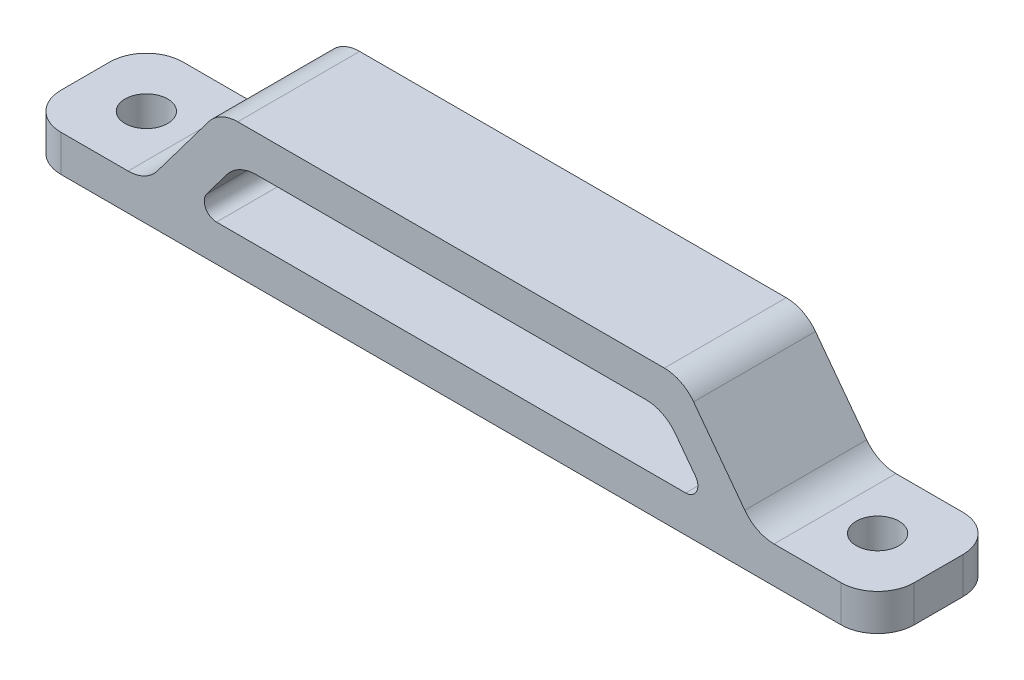
ISO-10303-21;
HEADER;
FILE_DESCRIPTION(('STEP AP214'),'2;1');
FILE_NAME('part.step','',(''),(''),'','','');
FILE_SCHEMA(('AUTOMOTIVE_DESIGN { 1 0 10303 214 1 1 1 1 }'));
ENDSEC;
DATA;
#1=APPLICATION_CONTEXT('core data for automotive mechanical design processes');
#2=APPLICATION_PROTOCOL_DEFINITION('international standard','automotive_design',2000,#1);
#3=PRODUCT_CONTEXT('',#1,'mechanical');
#4=PRODUCT('Part','Part','',(#3));
#5=PRODUCT_RELATED_PRODUCT_CATEGORY('part','',(#4));
#6=PRODUCT_DEFINITION_FORMATION('','',#4);
#7=PRODUCT_DEFINITION_CONTEXT('part definition',#1,'design');
#8=PRODUCT_DEFINITION('design','',#6,#7);
#9=PRODUCT_DEFINITION_SHAPE('','',#8);
#10=(LENGTH_UNIT() NAMED_UNIT(*) SI_UNIT(.MILLI.,.METRE.));
#11=(NAMED_UNIT(*) PLANE_ANGLE_UNIT() SI_UNIT($,.RADIAN.));
#12=(NAMED_UNIT(*) SI_UNIT($,.STERADIAN.) SOLID_ANGLE_UNIT());
#13=UNCERTAINTY_MEASURE_WITH_UNIT(LENGTH_MEASURE(1.E-05),#10,'distance_accuracy_value','');
#14=(GEOMETRIC_REPRESENTATION_CONTEXT(3) GLOBAL_UNCERTAINTY_ASSIGNED_CONTEXT((#13)) GLOBAL_UNIT_ASSIGNED_CONTEXT((#10,
#11,#12)) REPRESENTATION_CONTEXT('',''));
#15=CARTESIAN_POINT('',(0.,0.,0.));
#16=DIRECTION('',(0.,0.,1.));
#17=DIRECTION('',(1.,0.,0.));
#18=AXIS2_PLACEMENT_3D('',#15,#16,#17);
#19=CARTESIAN_POINT('',(0.,3.,0.));
#20=DIRECTION('',(0.,-1.,0.));
#21=DIRECTION('',(0.,0.,-1.));
#22=AXIS2_PLACEMENT_3D('',#19,#20,#21);
#23=PLANE('',#22);
#24=CARTESIAN_POINT('',(5.,3.,-5.));
#25=DIRECTION('',(0.,1.,0.));
#26=DIRECTION('',(0.,0.,1.));
#27=AXIS2_PLACEMENT_3D('',#24,#25,#26);
#28=CIRCLE('',#27,1.75);
#29=CARTESIAN_POINT('',(5.,3.,-3.25));
#30=VERTEX_POINT('',#29);
#31=EDGE_CURVE('E332',#30,#30,#28,.T.);
#32=ORIENTED_EDGE('',*,*,#31,.F.);
#33=EDGE_LOOP('',(#32));
#34=FACE_BOUND('',#33,.T.);
#35=DIRECTION('',(1.,0.,0.));
#36=VECTOR('',#35,1.);
#37=CARTESIAN_POINT('',(0.,3.,0.));
#38=LINE('',#37,#36);
#39=CARTESIAN_POINT('',(3.,3.,0.));
#40=VERTEX_POINT('',#39);
#41=CARTESIAN_POINT('',(8.5,3.,0.));
#42=VERTEX_POINT('',#41);
#43=EDGE_CURVE('E343',#40,#42,#38,.T.);
#44=ORIENTED_EDGE('',*,*,#43,.T.);
#45=DIRECTION('',(0.,0.,1.));
#46=VECTOR('',#45,1.);
#47=CARTESIAN_POINT('',(8.5,3.,0.));
#48=LINE('',#47,#46);
#49=CARTESIAN_POINT('',(8.5,3.,-10.));
#50=VERTEX_POINT('',#49);
#51=EDGE_CURVE('E386',#42,#50,#48,.F.);
#52=ORIENTED_EDGE('',*,*,#51,.T.);
#53=DIRECTION('',(-1.,0.,0.));
#54=VECTOR('',#53,1.);
#55=CARTESIAN_POINT('',(0.,3.,-10.));
#56=LINE('',#55,#54);
#57=CARTESIAN_POINT('',(3.,3.,-10.));
#58=VERTEX_POINT('',#57);
#59=EDGE_CURVE('E349',#50,#58,#56,.T.);
#60=ORIENTED_EDGE('',*,*,#59,.T.);
#61=CARTESIAN_POINT('',(3.,3.,-7.));
#62=DIRECTION('',(0.,-1.,0.));
#63=DIRECTION('',(0.,0.,-1.));
#64=AXIS2_PLACEMENT_3D('',#61,#62,#63);
#65=CIRCLE('',#64,3.);
#66=CARTESIAN_POINT('',(0.,3.,-7.));
#67=VERTEX_POINT('',#66);
#68=EDGE_CURVE('E384',#58,#67,#65,.F.);
#69=ORIENTED_EDGE('',*,*,#68,.T.);
#70=DIRECTION('',(0.,0.,1.));
#71=VECTOR('',#70,1.);
#72=CARTESIAN_POINT('',(0.,3.,0.));
#73=LINE('',#72,#71);
#74=CARTESIAN_POINT('',(0.,3.,-3.));
#75=VERTEX_POINT('',#74);
#76=EDGE_CURVE('E338',#67,#75,#73,.T.);
#77=ORIENTED_EDGE('',*,*,#76,.T.);
#78=CARTESIAN_POINT('',(3.,3.,-3.));
#79=DIRECTION('',(0.,-1.,0.));
#80=DIRECTION('',(0.,0.,-1.));
#81=AXIS2_PLACEMENT_3D('',#78,#79,#80);
#82=CIRCLE('',#81,3.);
#83=EDGE_CURVE('E382',#75,#40,#82,.F.);
#84=ORIENTED_EDGE('',*,*,#83,.T.);
#85=EDGE_LOOP('',(#44,#52,#60,#69,#77,#84));
#86=FACE_BOUND('',#85,.T.);
#87=ADVANCED_FACE('F63',(#34,#86),#23,.F.);
#88=CARTESIAN_POINT('',(67.,3.,-10.));
#89=VERTEX_POINT('',#88);
#90=CARTESIAN_POINT('',(61.5,3.,-10.));
#91=VERTEX_POINT('',#90);
#92=EDGE_CURVE('E235',#89,#91,#56,.T.);
#93=ORIENTED_EDGE('',*,*,#92,.T.);
#94=DIRECTION('',(0.,0.,1.));
#95=VECTOR('',#94,1.);
#96=CARTESIAN_POINT('',(61.5,3.,0.));
#97=LINE('',#96,#95);
#98=CARTESIAN_POINT('',(61.5,3.,0.));
#99=VERTEX_POINT('',#98);
#100=EDGE_CURVE('E369',#91,#99,#97,.T.);
#101=ORIENTED_EDGE('',*,*,#100,.T.);
#102=CARTESIAN_POINT('',(67.,3.,0.));
#103=VERTEX_POINT('',#102);
#104=EDGE_CURVE('E341',#99,#103,#38,.T.);
#105=ORIENTED_EDGE('',*,*,#104,.T.);
#106=CARTESIAN_POINT('',(67.,3.,-2.99999999999999));
#107=DIRECTION('',(0.,-1.,0.));
#108=DIRECTION('',(0.,0.,-1.));
#109=AXIS2_PLACEMENT_3D('',#106,#107,#108);
#110=CIRCLE('',#109,3.);
#111=CARTESIAN_POINT('',(70.,3.,-2.99999999999999));
#112=VERTEX_POINT('',#111);
#113=EDGE_CURVE('E367',#103,#112,#110,.F.);
#114=ORIENTED_EDGE('',*,*,#113,.T.);
#115=DIRECTION('',(0.,0.,-1.));
#116=VECTOR('',#115,1.);
#117=CARTESIAN_POINT('',(70.,3.,0.));
#118=LINE('',#117,#116);
#119=CARTESIAN_POINT('',(70.,3.,-7.00000000000001));
#120=VERTEX_POINT('',#119);
#121=EDGE_CURVE('E346',#112,#120,#118,.T.);
#122=ORIENTED_EDGE('',*,*,#121,.T.);
#123=CARTESIAN_POINT('',(67.,3.,-7.00000000000001));
#124=DIRECTION('',(0.,-1.,0.));
#125=DIRECTION('',(0.,0.,-1.));
#126=AXIS2_PLACEMENT_3D('',#123,#124,#125);
#127=CIRCLE('',#126,3.);
#128=EDGE_CURVE('E365',#120,#89,#127,.F.);
#129=ORIENTED_EDGE('',*,*,#128,.T.);
#130=EDGE_LOOP('',(#93,#101,#105,#114,#122,#129));
#131=FACE_BOUND('',#130,.T.);
#132=CARTESIAN_POINT('',(65.,3.,-5.00000000000001));
#133=DIRECTION('',(0.,1.,0.));
#134=DIRECTION('',(0.,0.,-1.));
#135=AXIS2_PLACEMENT_3D('',#132,#133,#134);
#136=CIRCLE('',#135,1.75);
#137=CARTESIAN_POINT('',(65.,3.,-6.75));
#138=VERTEX_POINT('',#137);
#139=EDGE_CURVE('E326',#138,#138,#136,.T.);
#140=ORIENTED_EDGE('',*,*,#139,.F.);
#141=EDGE_LOOP('',(#140));
#142=FACE_BOUND('',#141,.T.);
#143=ADVANCED_FACE('F445',(#131,#142),#23,.F.);
#144=CARTESIAN_POINT('',(0.,0.,0.));
#145=DIRECTION('',(0.,-1.,0.));
#146=DIRECTION('',(0.,0.,-1.));
#147=AXIS2_PLACEMENT_3D('',#144,#145,#146);
#148=PLANE('',#147);
#149=CARTESIAN_POINT('',(5.,0.,-5.));
#150=DIRECTION('',(0.,1.,0.));
#151=DIRECTION('',(0.,0.,1.));
#152=AXIS2_PLACEMENT_3D('',#149,#150,#151);
#153=CIRCLE('',#152,1.75);
#154=CARTESIAN_POINT('',(5.,0.,-3.25));
#155=VERTEX_POINT('',#154);
#156=EDGE_CURVE('E329',#155,#155,#153,.T.);
#157=ORIENTED_EDGE('',*,*,#156,.T.);
#158=EDGE_LOOP('',(#157));
#159=FACE_BOUND('',#158,.T.);
#160=DIRECTION('',(0.,0.,-1.));
#161=VECTOR('',#160,1.);
#162=CARTESIAN_POINT('',(70.,0.,0.));
#163=LINE('',#162,#161);
#164=CARTESIAN_POINT('',(70.,0.,-2.99999999999999));
#165=VERTEX_POINT('',#164);
#166=CARTESIAN_POINT('',(70.,0.,-7.00000000000001));
#167=VERTEX_POINT('',#166);
#168=EDGE_CURVE('E357',#165,#167,#163,.T.);
#169=ORIENTED_EDGE('',*,*,#168,.F.);
#170=CARTESIAN_POINT('',(67.,0.,-2.99999999999999));
#171=DIRECTION('',(0.,-1.,0.));
#172=DIRECTION('',(0.,0.,-1.));
#173=AXIS2_PLACEMENT_3D('',#170,#171,#172);
#174=CIRCLE('',#173,3.);
#175=CARTESIAN_POINT('',(67.,0.,0.));
#176=VERTEX_POINT('',#175);
#177=EDGE_CURVE('E399',#165,#176,#174,.T.);
#178=ORIENTED_EDGE('',*,*,#177,.T.);
#179=DIRECTION('',(1.,0.,0.));
#180=VECTOR('',#179,1.);
#181=CARTESIAN_POINT('',(0.,0.,0.));
#182=LINE('',#181,#180);
#183=CARTESIAN_POINT('',(3.,0.,0.));
#184=VERTEX_POINT('',#183);
#185=EDGE_CURVE('E354',#184,#176,#182,.T.);
#186=ORIENTED_EDGE('',*,*,#185,.F.);
#187=CARTESIAN_POINT('',(3.,0.,-3.));
#188=DIRECTION('',(0.,-1.,0.));
#189=DIRECTION('',(0.,0.,-1.));
#190=AXIS2_PLACEMENT_3D('',#187,#188,#189);
#191=CIRCLE('',#190,3.);
#192=CARTESIAN_POINT('',(0.,0.,-3.));
#193=VERTEX_POINT('',#192);
#194=EDGE_CURVE('E393',#184,#193,#191,.T.);
#195=ORIENTED_EDGE('',*,*,#194,.T.);
#196=DIRECTION('',(0.,0.,1.));
#197=VECTOR('',#196,1.);
#198=CARTESIAN_POINT('',(0.,0.,0.));
#199=LINE('',#198,#197);
#200=CARTESIAN_POINT('',(0.,0.,-7.));
#201=VERTEX_POINT('',#200);
#202=EDGE_CURVE('E335',#201,#193,#199,.T.);
#203=ORIENTED_EDGE('',*,*,#202,.F.);
#204=CARTESIAN_POINT('',(3.,0.,-7.));
#205=DIRECTION('',(0.,-1.,0.));
#206=DIRECTION('',(0.,0.,-1.));
#207=AXIS2_PLACEMENT_3D('',#204,#205,#206);
#208=CIRCLE('',#207,3.);
#209=CARTESIAN_POINT('',(3.,0.,-10.));
#210=VERTEX_POINT('',#209);
#211=EDGE_CURVE('E395',#201,#210,#208,.T.);
#212=ORIENTED_EDGE('',*,*,#211,.T.);
#213=DIRECTION('',(-1.,0.,0.));
#214=VECTOR('',#213,1.);
#215=CARTESIAN_POINT('',(0.,0.,-10.));
#216=LINE('',#215,#214);
#217=CARTESIAN_POINT('',(67.,0.,-10.));
#218=VERTEX_POINT('',#217);
#219=EDGE_CURVE('E342',#218,#210,#216,.T.);
#220=ORIENTED_EDGE('',*,*,#219,.F.);
#221=CARTESIAN_POINT('',(67.,0.,-7.00000000000001));
#222=DIRECTION('',(0.,-1.,0.));
#223=DIRECTION('',(0.,0.,-1.));
#224=AXIS2_PLACEMENT_3D('',#221,#222,#223);
#225=CIRCLE('',#224,3.);
#226=EDGE_CURVE('E397',#218,#167,#225,.T.);
#227=ORIENTED_EDGE('',*,*,#226,.T.);
#228=EDGE_LOOP('',(#169,#178,#186,#195,#203,#212,#220,#227));
#229=FACE_BOUND('',#228,.T.);
#230=CARTESIAN_POINT('',(65.,0.,-5.00000000000001));
#231=DIRECTION('',(0.,1.,0.));
#232=DIRECTION('',(0.,0.,-1.));
#233=AXIS2_PLACEMENT_3D('',#230,#231,#232);
#234=CIRCLE('',#233,1.75);
#235=CARTESIAN_POINT('',(65.,0.,-6.75));
#236=VERTEX_POINT('',#235);
#237=EDGE_CURVE('E310',#236,#236,#234,.T.);
#238=ORIENTED_EDGE('',*,*,#237,.T.);
#239=EDGE_LOOP('',(#238));
#240=FACE_BOUND('',#239,.T.);
#241=ADVANCED_FACE('F452',(#159,#229,#240),#148,.T.);
#242=CARTESIAN_POINT('',(0.,3.,0.));
#243=DIRECTION('',(1.,0.,0.));
#244=DIRECTION('',(0.,0.,-1.));
#245=AXIS2_PLACEMENT_3D('',#242,#243,#244);
#246=PLANE('',#245);
#247=ORIENTED_EDGE('',*,*,#76,.F.);
#248=DIRECTION('',(0.,-1.,0.));
#249=VECTOR('',#248,1.);
#250=CARTESIAN_POINT('',(0.,3.,-7.));
#251=LINE('',#250,#249);
#252=EDGE_CURVE('E421',#67,#201,#251,.T.);
#253=ORIENTED_EDGE('',*,*,#252,.T.);
#254=ORIENTED_EDGE('',*,*,#202,.T.);
#255=DIRECTION('',(0.,-1.,0.));
#256=VECTOR('',#255,1.);
#257=CARTESIAN_POINT('',(0.,3.,-3.));
#258=LINE('',#257,#256);
#259=EDGE_CURVE('E419',#193,#75,#258,.F.);
#260=ORIENTED_EDGE('',*,*,#259,.T.);
#261=EDGE_LOOP('',(#247,#253,#254,#260));
#262=FACE_BOUND('',#261,.T.);
#263=ADVANCED_FACE('F462',(#262),#246,.F.);
#264=CARTESIAN_POINT('',(0.,3.,0.));
#265=DIRECTION('',(0.,0.,-1.));
#266=DIRECTION('',(-1.,0.,0.));
#267=AXIS2_PLACEMENT_3D('',#264,#265,#266);
#268=PLANE('',#267);
#269=ORIENTED_EDGE('',*,*,#185,.T.);
#270=DIRECTION('',(0.,-1.,0.));
#271=VECTOR('',#270,1.);
#272=CARTESIAN_POINT('',(67.,3.,0.));
#273=LINE('',#272,#271);
#274=EDGE_CURVE('E408',#176,#103,#273,.F.);
#275=ORIENTED_EDGE('',*,*,#274,.T.);
#276=ORIENTED_EDGE('',*,*,#104,.F.);
#277=CARTESIAN_POINT('',(61.5,6.,0.));
#278=DIRECTION('',(0.,0.,-1.));
#279=DIRECTION('',(-1.,0.,0.));
#280=AXIS2_PLACEMENT_3D('',#277,#278,#279);
#281=CIRCLE('',#280,3.);
#282=CARTESIAN_POINT('',(59.1,4.2,0.));
#283=VERTEX_POINT('',#282);
#284=EDGE_CURVE('E252',#99,#283,#281,.T.);
#285=ORIENTED_EDGE('',*,*,#284,.T.);
#286=DIRECTION('',(-0.6,0.8,0.));
#287=VECTOR('',#286,1.);
#288=CARTESIAN_POINT('',(60.,3.,0.));
#289=LINE('',#288,#287);
#290=CARTESIAN_POINT('',(54.9,9.8,0.));
#291=VERTEX_POINT('',#290);
#292=EDGE_CURVE('E318',#283,#291,#289,.T.);
#293=ORIENTED_EDGE('',*,*,#292,.T.);
#294=CARTESIAN_POINT('',(52.5,8.,0.));
#295=DIRECTION('',(0.,0.,-1.));
#296=DIRECTION('',(-1.,0.,0.));
#297=AXIS2_PLACEMENT_3D('',#294,#295,#296);
#298=CIRCLE('',#297,3.);
#299=CARTESIAN_POINT('',(52.5,11.,0.));
#300=VERTEX_POINT('',#299);
#301=EDGE_CURVE('E401',#291,#300,#298,.F.);
#302=ORIENTED_EDGE('',*,*,#301,.T.);
#303=DIRECTION('',(-1.,0.,0.));
#304=VECTOR('',#303,1.);
#305=CARTESIAN_POINT('',(16.,11.,0.));
#306=LINE('',#305,#304);
#307=CARTESIAN_POINT('',(17.5,11.,0.));
#308=VERTEX_POINT('',#307);
#309=EDGE_CURVE('E321',#300,#308,#306,.T.);
#310=ORIENTED_EDGE('',*,*,#309,.T.);
#311=CARTESIAN_POINT('',(17.5,8.,0.));
#312=DIRECTION('',(0.,0.,-1.));
#313=DIRECTION('',(-1.,0.,0.));
#314=AXIS2_PLACEMENT_3D('',#311,#312,#313);
#315=CIRCLE('',#314,3.);
#316=CARTESIAN_POINT('',(15.1,9.8,0.));
#317=VERTEX_POINT('',#316);
#318=EDGE_CURVE('E403',#308,#317,#315,.F.);
#319=ORIENTED_EDGE('',*,*,#318,.T.);
#320=DIRECTION('',(-0.6,-0.8,0.));
#321=VECTOR('',#320,1.);
#322=CARTESIAN_POINT('',(10.,3.,0.));
#323=LINE('',#322,#321);
#324=CARTESIAN_POINT('',(10.9,4.2,0.));
#325=VERTEX_POINT('',#324);
#326=EDGE_CURVE('E291',#317,#325,#323,.T.);
#327=ORIENTED_EDGE('',*,*,#326,.T.);
#328=CARTESIAN_POINT('',(8.5,6.,0.));
#329=DIRECTION('',(0.,0.,-1.));
#330=DIRECTION('',(-1.,0.,0.));
#331=AXIS2_PLACEMENT_3D('',#328,#329,#330);
#332=CIRCLE('',#331,3.);
#333=EDGE_CURVE('E261',#325,#42,#332,.T.);
#334=ORIENTED_EDGE('',*,*,#333,.T.);
#335=ORIENTED_EDGE('',*,*,#43,.F.);
#336=DIRECTION('',(0.,-1.,0.));
#337=VECTOR('',#336,1.);
#338=CARTESIAN_POINT('',(3.,3.,0.));
#339=LINE('',#338,#337);
#340=EDGE_CURVE('E405',#40,#184,#339,.T.);
#341=ORIENTED_EDGE('',*,*,#340,.T.);
#342=EDGE_LOOP('',(#269,#275,#276,#285,#293,#302,#310,#319,#327,#334,#335,#341));
#343=FACE_BOUND('',#342,.T.);
#344=DIRECTION('',(-0.6,0.8,0.));
#345=VECTOR('',#344,1.);
#346=CARTESIAN_POINT('',(57.6,1.2,0.));
#347=LINE('',#346,#345);
#348=CARTESIAN_POINT('',(55.05,4.6,0.));
#349=VERTEX_POINT('',#348);
#350=CARTESIAN_POINT('',(53.4,6.80000000000001,0.));
#351=VERTEX_POINT('',#350);
#352=EDGE_CURVE('E298',#349,#351,#347,.T.);
#353=ORIENTED_EDGE('',*,*,#352,.F.);
#354=CARTESIAN_POINT('',(54.25,4.,0.));
#355=DIRECTION('',(0.,0.,-1.));
#356=DIRECTION('',(-1.,0.,0.));
#357=AXIS2_PLACEMENT_3D('',#354,#355,#356);
#358=CIRCLE('',#357,1.);
#359=CARTESIAN_POINT('',(54.25,3.,0.));
#360=VERTEX_POINT('',#359);
#361=EDGE_CURVE('E274',#349,#360,#358,.T.);
#362=ORIENTED_EDGE('',*,*,#361,.T.);
#363=DIRECTION('',(1.,0.,0.));
#364=VECTOR('',#363,1.);
#365=CARTESIAN_POINT('',(13.75,3.,0.));
#366=LINE('',#365,#364);
#367=CARTESIAN_POINT('',(15.75,3.,0.));
#368=VERTEX_POINT('',#367);
#369=EDGE_CURVE('E296',#368,#360,#366,.T.);
#370=ORIENTED_EDGE('',*,*,#369,.F.);
#371=CARTESIAN_POINT('',(15.75,4.,0.));
#372=DIRECTION('',(0.,0.,-1.));
#373=DIRECTION('',(-1.,0.,0.));
#374=AXIS2_PLACEMENT_3D('',#371,#372,#373);
#375=CIRCLE('',#374,1.);
#376=CARTESIAN_POINT('',(14.95,4.6,0.));
#377=VERTEX_POINT('',#376);
#378=EDGE_CURVE('E71',#368,#377,#375,.T.);
#379=ORIENTED_EDGE('',*,*,#378,.T.);
#380=DIRECTION('',(-0.6,-0.8,0.));
#381=VECTOR('',#380,1.);
#382=CARTESIAN_POINT('',(12.4,1.2,0.));
#383=LINE('',#382,#381);
#384=CARTESIAN_POINT('',(16.6,6.8,0.));
#385=VERTEX_POINT('',#384);
#386=EDGE_CURVE('E316',#385,#377,#383,.T.);
#387=ORIENTED_EDGE('',*,*,#386,.F.);
#388=CARTESIAN_POINT('',(19.,5.,0.));
#389=DIRECTION('',(0.,0.,-1.));
#390=DIRECTION('',(-1.,0.,0.));
#391=AXIS2_PLACEMENT_3D('',#388,#389,#390);
#392=CIRCLE('',#391,3.);
#393=CARTESIAN_POINT('',(19.,8.,0.));
#394=VERTEX_POINT('',#393);
#395=EDGE_CURVE('E253',#385,#394,#392,.T.);
#396=ORIENTED_EDGE('',*,*,#395,.T.);
#397=DIRECTION('',(-1.,0.,0.));
#398=VECTOR('',#397,1.);
#399=CARTESIAN_POINT('',(16.,8.,0.));
#400=LINE('',#399,#398);
#401=CARTESIAN_POINT('',(51.,8.,0.));
#402=VERTEX_POINT('',#401);
#403=EDGE_CURVE('E231',#402,#394,#400,.T.);
#404=ORIENTED_EDGE('',*,*,#403,.F.);
#405=CARTESIAN_POINT('',(51.,5.,0.));
#406=DIRECTION('',(0.,0.,-1.));
#407=DIRECTION('',(-1.,0.,0.));
#408=AXIS2_PLACEMENT_3D('',#405,#406,#407);
#409=CIRCLE('',#408,3.);
#410=EDGE_CURVE('E429',#402,#351,#409,.T.);
#411=ORIENTED_EDGE('',*,*,#410,.T.);
#412=EDGE_LOOP('',(#353,#362,#370,#379,#387,#396,#404,#411));
#413=FACE_BOUND('',#412,.T.);
#414=ADVANCED_FACE('F295',(#343,#413),#268,.F.);
#415=CARTESIAN_POINT('',(70.,3.,0.));
#416=DIRECTION('',(-1.,0.,0.));
#417=DIRECTION('',(0.,0.,1.));
#418=AXIS2_PLACEMENT_3D('',#415,#416,#417);
#419=PLANE('',#418);
#420=ORIENTED_EDGE('',*,*,#121,.F.);
#421=DIRECTION('',(0.,-1.,0.));
#422=VECTOR('',#421,1.);
#423=CARTESIAN_POINT('',(70.,3.,-2.99999999999999));
#424=LINE('',#423,#422);
#425=EDGE_CURVE('E390',#112,#165,#424,.T.);
#426=ORIENTED_EDGE('',*,*,#425,.T.);
#427=ORIENTED_EDGE('',*,*,#168,.T.);
#428=DIRECTION('',(0.,-1.,0.));
#429=VECTOR('',#428,1.);
#430=CARTESIAN_POINT('',(70.,3.,-7.00000000000001));
#431=LINE('',#430,#429);
#432=EDGE_CURVE('E388',#167,#120,#431,.F.);
#433=ORIENTED_EDGE('',*,*,#432,.T.);
#434=EDGE_LOOP('',(#420,#426,#427,#433));
#435=FACE_BOUND('',#434,.T.);
#436=ADVANCED_FACE('F466',(#435),#419,.F.);
#437=CARTESIAN_POINT('',(0.,3.,-10.));
#438=DIRECTION('',(0.,0.,1.));
#439=DIRECTION('',(1.,0.,0.));
#440=AXIS2_PLACEMENT_3D('',#437,#438,#439);
#441=PLANE('',#440);
#442=ORIENTED_EDGE('',*,*,#92,.F.);
#443=DIRECTION('',(0.,-1.,0.));
#444=VECTOR('',#443,1.);
#445=CARTESIAN_POINT('',(67.,3.,-10.));
#446=LINE('',#445,#444);
#447=EDGE_CURVE('E416',#89,#218,#446,.T.);
#448=ORIENTED_EDGE('',*,*,#447,.T.);
#449=ORIENTED_EDGE('',*,*,#219,.T.);
#450=DIRECTION('',(0.,-1.,0.));
#451=VECTOR('',#450,1.);
#452=CARTESIAN_POINT('',(3.,3.,-10.));
#453=LINE('',#452,#451);
#454=EDGE_CURVE('E414',#210,#58,#453,.F.);
#455=ORIENTED_EDGE('',*,*,#454,.T.);
#456=ORIENTED_EDGE('',*,*,#59,.F.);
#457=CARTESIAN_POINT('',(8.5,6.,-10.));
#458=DIRECTION('',(0.,0.,1.));
#459=DIRECTION('',(1.,0.,0.));
#460=AXIS2_PLACEMENT_3D('',#457,#458,#459);
#461=CIRCLE('',#460,3.);
#462=CARTESIAN_POINT('',(10.9,4.2,-10.));
#463=VERTEX_POINT('',#462);
#464=EDGE_CURVE('E263',#50,#463,#461,.T.);
#465=ORIENTED_EDGE('',*,*,#464,.T.);
#466=DIRECTION('',(0.6,0.8,0.));
#467=VECTOR('',#466,1.);
#468=CARTESIAN_POINT('',(10.,3.,-10.));
#469=LINE('',#468,#467);
#470=CARTESIAN_POINT('',(15.1,9.8,-10.));
#471=VERTEX_POINT('',#470);
#472=EDGE_CURVE('E307',#463,#471,#469,.T.);
#473=ORIENTED_EDGE('',*,*,#472,.T.);
#474=CARTESIAN_POINT('',(17.5,8.,-10.));
#475=DIRECTION('',(0.,0.,1.));
#476=DIRECTION('',(1.,0.,0.));
#477=AXIS2_PLACEMENT_3D('',#474,#475,#476);
#478=CIRCLE('',#477,3.);
#479=CARTESIAN_POINT('',(17.5,11.,-10.));
#480=VERTEX_POINT('',#479);
#481=EDGE_CURVE('E412',#471,#480,#478,.F.);
#482=ORIENTED_EDGE('',*,*,#481,.T.);
#483=DIRECTION('',(1.,0.,0.));
#484=VECTOR('',#483,1.);
#485=CARTESIAN_POINT('',(16.,11.,-10.));
#486=LINE('',#485,#484);
#487=CARTESIAN_POINT('',(52.5,11.,-10.));
#488=VERTEX_POINT('',#487);
#489=EDGE_CURVE('E290',#480,#488,#486,.T.);
#490=ORIENTED_EDGE('',*,*,#489,.T.);
#491=CARTESIAN_POINT('',(52.5,8.,-10.));
#492=DIRECTION('',(0.,0.,1.));
#493=DIRECTION('',(1.,0.,0.));
#494=AXIS2_PLACEMENT_3D('',#491,#492,#493);
#495=CIRCLE('',#494,3.);
#496=CARTESIAN_POINT('',(54.9,9.8,-10.));
#497=VERTEX_POINT('',#496);
#498=EDGE_CURVE('E410',#488,#497,#495,.F.);
#499=ORIENTED_EDGE('',*,*,#498,.T.);
#500=DIRECTION('',(0.6,-0.8,0.));
#501=VECTOR('',#500,1.);
#502=CARTESIAN_POINT('',(60.,3.,-10.));
#503=LINE('',#502,#501);
#504=CARTESIAN_POINT('',(59.1,4.2,-10.));
#505=VERTEX_POINT('',#504);
#506=EDGE_CURVE('E246',#497,#505,#503,.T.);
#507=ORIENTED_EDGE('',*,*,#506,.T.);
#508=CARTESIAN_POINT('',(61.5,6.,-10.));
#509=DIRECTION('',(0.,0.,1.));
#510=DIRECTION('',(1.,0.,0.));
#511=AXIS2_PLACEMENT_3D('',#508,#509,#510);
#512=CIRCLE('',#511,3.);
#513=EDGE_CURVE('E255',#505,#91,#512,.T.);
#514=ORIENTED_EDGE('',*,*,#513,.T.);
#515=EDGE_LOOP('',(#442,#448,#449,#455,#456,#465,#473,#482,#490,#499,#507,#514));
#516=FACE_BOUND('',#515,.T.);
#517=DIRECTION('',(-1.,0.,0.));
#518=VECTOR('',#517,1.);
#519=CARTESIAN_POINT('',(13.75,3.,-10.));
#520=LINE('',#519,#518);
#521=CARTESIAN_POINT('',(54.25,3.,-10.));
#522=VERTEX_POINT('',#521);
#523=CARTESIAN_POINT('',(15.75,3.,-10.));
#524=VERTEX_POINT('',#523);
#525=EDGE_CURVE('E281',#522,#524,#520,.T.);
#526=ORIENTED_EDGE('',*,*,#525,.F.);
#527=CARTESIAN_POINT('',(54.25,4.,-10.));
#528=DIRECTION('',(0.,0.,1.));
#529=DIRECTION('',(1.,0.,0.));
#530=AXIS2_PLACEMENT_3D('',#527,#528,#529);
#531=CIRCLE('',#530,1.);
#532=CARTESIAN_POINT('',(55.05,4.6,-10.));
#533=VERTEX_POINT('',#532);
#534=EDGE_CURVE('E276',#522,#533,#531,.T.);
#535=ORIENTED_EDGE('',*,*,#534,.T.);
#536=DIRECTION('',(0.6,-0.8,0.));
#537=VECTOR('',#536,1.);
#538=CARTESIAN_POINT('',(57.6,1.2,-10.));
#539=LINE('',#538,#537);
#540=CARTESIAN_POINT('',(53.4,6.80000000000001,-10.));
#541=VERTEX_POINT('',#540);
#542=EDGE_CURVE('E279',#541,#533,#539,.T.);
#543=ORIENTED_EDGE('',*,*,#542,.F.);
#544=CARTESIAN_POINT('',(51.,5.,-10.));
#545=DIRECTION('',(0.,0.,1.));
#546=DIRECTION('',(1.,0.,0.));
#547=AXIS2_PLACEMENT_3D('',#544,#545,#546);
#548=CIRCLE('',#547,3.);
#549=CARTESIAN_POINT('',(51.,8.,-10.));
#550=VERTEX_POINT('',#549);
#551=EDGE_CURVE('E245',#541,#550,#548,.T.);
#552=ORIENTED_EDGE('',*,*,#551,.T.);
#553=DIRECTION('',(1.,0.,0.));
#554=VECTOR('',#553,1.);
#555=CARTESIAN_POINT('',(16.,8.,-10.));
#556=LINE('',#555,#554);
#557=CARTESIAN_POINT('',(19.,8.,-10.));
#558=VERTEX_POINT('',#557);
#559=EDGE_CURVE('E228',#558,#550,#556,.T.);
#560=ORIENTED_EDGE('',*,*,#559,.F.);
#561=CARTESIAN_POINT('',(19.,5.,-10.));
#562=DIRECTION('',(0.,0.,1.));
#563=DIRECTION('',(1.,0.,0.));
#564=AXIS2_PLACEMENT_3D('',#561,#562,#563);
#565=CIRCLE('',#564,3.);
#566=CARTESIAN_POINT('',(16.6,6.8,-10.));
#567=VERTEX_POINT('',#566);
#568=EDGE_CURVE('E241',#558,#567,#565,.T.);
#569=ORIENTED_EDGE('',*,*,#568,.T.);
#570=DIRECTION('',(0.6,0.8,0.));
#571=VECTOR('',#570,1.);
#572=CARTESIAN_POINT('',(12.4,1.20000000000001,-10.));
#573=LINE('',#572,#571);
#574=CARTESIAN_POINT('',(14.95,4.6,-10.));
#575=VERTEX_POINT('',#574);
#576=EDGE_CURVE('E247',#575,#567,#573,.T.);
#577=ORIENTED_EDGE('',*,*,#576,.F.);
#578=CARTESIAN_POINT('',(15.75,4.,-10.));
#579=DIRECTION('',(0.,0.,1.));
#580=DIRECTION('',(1.,0.,0.));
#581=AXIS2_PLACEMENT_3D('',#578,#579,#580);
#582=CIRCLE('',#581,1.);
#583=EDGE_CURVE('E12',#575,#524,#582,.T.);
#584=ORIENTED_EDGE('',*,*,#583,.T.);
#585=EDGE_LOOP('',(#526,#535,#543,#552,#560,#569,#577,#584));
#586=FACE_BOUND('',#585,.T.);
#587=ADVANCED_FACE('F240',(#516,#586),#441,.F.);
#588=CARTESIAN_POINT('',(5.,3.,-5.));
#589=DIRECTION('',(0.,-1.,0.));
#590=DIRECTION('',(0.,0.,-1.));
#591=AXIS2_PLACEMENT_3D('',#588,#589,#590);
#592=CYLINDRICAL_SURFACE('',#591,1.75);
#593=ORIENTED_EDGE('',*,*,#31,.T.);
#594=EDGE_LOOP('',(#593));
#595=FACE_BOUND('',#594,.T.);
#596=ORIENTED_EDGE('',*,*,#156,.F.);
#597=EDGE_LOOP('',(#596));
#598=FACE_BOUND('',#597,.T.);
#599=ADVANCED_FACE('F458',(#595,#598),#592,.F.);
#600=CARTESIAN_POINT('',(65.,3.,-5.00000000000001));
#601=DIRECTION('',(0.,-1.,0.));
#602=DIRECTION('',(0.,0.,-1.));
#603=AXIS2_PLACEMENT_3D('',#600,#601,#602);
#604=CYLINDRICAL_SURFACE('',#603,1.75);
#605=ORIENTED_EDGE('',*,*,#139,.T.);
#606=EDGE_LOOP('',(#605));
#607=FACE_BOUND('',#606,.T.);
#608=ORIENTED_EDGE('',*,*,#237,.F.);
#609=EDGE_LOOP('',(#608));
#610=FACE_BOUND('',#609,.T.);
#611=ADVANCED_FACE('F545',(#607,#610),#604,.F.);
#612=CARTESIAN_POINT('',(60.,3.,-60.6359556046887));
#613=DIRECTION('',(0.8,0.6,0.));
#614=DIRECTION('',(-0.6,0.8,0.));
#615=AXIS2_PLACEMENT_3D('',#612,#613,#614);
#616=PLANE('',#615);
#617=ORIENTED_EDGE('',*,*,#292,.F.);
#618=DIRECTION('',(0.,0.,1.));
#619=VECTOR('',#618,1.);
#620=CARTESIAN_POINT('',(59.1,4.2,-60.6359556046887));
#621=LINE('',#620,#619);
#622=EDGE_CURVE('E375',#283,#505,#621,.F.);
#623=ORIENTED_EDGE('',*,*,#622,.T.);
#624=ORIENTED_EDGE('',*,*,#506,.F.);
#625=DIRECTION('',(0.,0.,1.));
#626=VECTOR('',#625,1.);
#627=CARTESIAN_POINT('',(54.9,9.8,-60.6359556046887));
#628=LINE('',#627,#626);
#629=EDGE_CURVE('E372',#497,#291,#628,.T.);
#630=ORIENTED_EDGE('',*,*,#629,.T.);
#631=EDGE_LOOP('',(#617,#623,#624,#630));
#632=FACE_BOUND('',#631,.T.);
#633=ADVANCED_FACE('F538',(#632),#616,.T.);
#634=CARTESIAN_POINT('',(16.,11.,-60.6359556046887));
#635=DIRECTION('',(0.,1.,0.));
#636=DIRECTION('',(0.,0.,1.));
#637=AXIS2_PLACEMENT_3D('',#634,#635,#636);
#638=PLANE('',#637);
#639=ORIENTED_EDGE('',*,*,#489,.F.);
#640=DIRECTION('',(0.,0.,1.));
#641=VECTOR('',#640,1.);
#642=CARTESIAN_POINT('',(17.5,11.,-60.6359556046887));
#643=LINE('',#642,#641);
#644=EDGE_CURVE('E426',#480,#308,#643,.T.);
#645=ORIENTED_EDGE('',*,*,#644,.T.);
#646=ORIENTED_EDGE('',*,*,#309,.F.);
#647=DIRECTION('',(0.,0.,1.));
#648=VECTOR('',#647,1.);
#649=CARTESIAN_POINT('',(52.5,11.,-60.6359556046887));
#650=LINE('',#649,#648);
#651=EDGE_CURVE('E424',#300,#488,#650,.F.);
#652=ORIENTED_EDGE('',*,*,#651,.T.);
#653=EDGE_LOOP('',(#639,#645,#646,#652));
#654=FACE_BOUND('',#653,.T.);
#655=ADVANCED_FACE('F528',(#654),#638,.T.);
#656=CARTESIAN_POINT('',(10.,3.,-60.6359556046887));
#657=DIRECTION('',(-0.8,0.6,0.));
#658=DIRECTION('',(-0.6,-0.8,0.));
#659=AXIS2_PLACEMENT_3D('',#656,#657,#658);
#660=PLANE('',#659);
#661=ORIENTED_EDGE('',*,*,#472,.F.);
#662=DIRECTION('',(0.,0.,1.));
#663=VECTOR('',#662,1.);
#664=CARTESIAN_POINT('',(10.9,4.2,-60.6359556046887));
#665=LINE('',#664,#663);
#666=EDGE_CURVE('E379',#463,#325,#665,.T.);
#667=ORIENTED_EDGE('',*,*,#666,.T.);
#668=ORIENTED_EDGE('',*,*,#326,.F.);
#669=DIRECTION('',(0.,0.,1.));
#670=VECTOR('',#669,1.);
#671=CARTESIAN_POINT('',(15.1,9.8,-60.6359556046887));
#672=LINE('',#671,#670);
#673=EDGE_CURVE('E377',#317,#471,#672,.F.);
#674=ORIENTED_EDGE('',*,*,#673,.T.);
#675=EDGE_LOOP('',(#661,#667,#668,#674));
#676=FACE_BOUND('',#675,.T.);
#677=ADVANCED_FACE('F519',(#676),#660,.T.);
#678=CARTESIAN_POINT('',(57.6,1.2,-60.6359556046887));
#679=DIRECTION('',(0.8,0.6,0.));
#680=DIRECTION('',(-0.6,0.8,0.));
#681=AXIS2_PLACEMENT_3D('',#678,#679,#680);
#682=PLANE('',#681);
#683=ORIENTED_EDGE('',*,*,#542,.T.);
#684=DIRECTION('',(0.,0.,1.));
#685=VECTOR('',#684,1.);
#686=CARTESIAN_POINT('',(55.05,4.6,0.));
#687=LINE('',#686,#685);
#688=EDGE_CURVE('E265',#533,#349,#687,.T.);
#689=ORIENTED_EDGE('',*,*,#688,.T.);
#690=ORIENTED_EDGE('',*,*,#352,.T.);
#691=DIRECTION('',(0.,0.,1.));
#692=VECTOR('',#691,1.);
#693=CARTESIAN_POINT('',(53.4,6.80000000000001,-10.));
#694=LINE('',#693,#692);
#695=EDGE_CURVE('E289',#351,#541,#694,.F.);
#696=ORIENTED_EDGE('',*,*,#695,.T.);
#697=EDGE_LOOP('',(#683,#689,#690,#696));
#698=FACE_BOUND('',#697,.T.);
#699=ADVANCED_FACE('F286',(#698),#682,.F.);
#700=CARTESIAN_POINT('',(16.,8.,-60.6359556046887));
#701=DIRECTION('',(0.,1.,0.));
#702=DIRECTION('',(0.,0.,1.));
#703=AXIS2_PLACEMENT_3D('',#700,#701,#702);
#704=PLANE('',#703);
#705=ORIENTED_EDGE('',*,*,#559,.T.);
#706=DIRECTION('',(0.,0.,1.));
#707=VECTOR('',#706,1.);
#708=CARTESIAN_POINT('',(51.,8.,0.));
#709=LINE('',#708,#707);
#710=EDGE_CURVE('E234',#550,#402,#709,.T.);
#711=ORIENTED_EDGE('',*,*,#710,.T.);
#712=ORIENTED_EDGE('',*,*,#403,.T.);
#713=DIRECTION('',(0.,0.,1.));
#714=VECTOR('',#713,1.);
#715=CARTESIAN_POINT('',(19.,8.,-10.));
#716=LINE('',#715,#714);
#717=EDGE_CURVE('E224',#394,#558,#716,.F.);
#718=ORIENTED_EDGE('',*,*,#717,.T.);
#719=EDGE_LOOP('',(#705,#711,#712,#718));
#720=FACE_BOUND('',#719,.T.);
#721=ADVANCED_FACE('F226',(#720),#704,.F.);
#722=CARTESIAN_POINT('',(12.4,1.2,-60.6359556046887));
#723=DIRECTION('',(-0.8,0.6,0.));
#724=DIRECTION('',(-0.6,-0.8,0.));
#725=AXIS2_PLACEMENT_3D('',#722,#723,#724);
#726=PLANE('',#725);
#727=ORIENTED_EDGE('',*,*,#386,.T.);
#728=DIRECTION('',(0.,0.,1.));
#729=VECTOR('',#728,1.);
#730=CARTESIAN_POINT('',(14.95,4.6,-10.));
#731=LINE('',#730,#729);
#732=EDGE_CURVE('E84',#377,#575,#731,.F.);
#733=ORIENTED_EDGE('',*,*,#732,.T.);
#734=ORIENTED_EDGE('',*,*,#576,.T.);
#735=DIRECTION('',(0.,0.,1.));
#736=VECTOR('',#735,1.);
#737=CARTESIAN_POINT('',(16.6,6.8,0.));
#738=LINE('',#737,#736);
#739=EDGE_CURVE('E251',#567,#385,#738,.T.);
#740=ORIENTED_EDGE('',*,*,#739,.T.);
#741=EDGE_LOOP('',(#727,#733,#734,#740));
#742=FACE_BOUND('',#741,.T.);
#743=ADVANCED_FACE('F441',(#742),#726,.F.);
#744=CARTESIAN_POINT('',(13.75,3.,-10.001));
#745=DIRECTION('',(0.,-1.,0.));
#746=DIRECTION('',(0.,0.,-1.));
#747=AXIS2_PLACEMENT_3D('',#744,#745,#746);
#748=PLANE('',#747);
#749=ORIENTED_EDGE('',*,*,#369,.T.);
#750=DIRECTION('',(0.,0.,1.));
#751=VECTOR('',#750,1.);
#752=CARTESIAN_POINT('',(54.25,3.,-10.));
#753=LINE('',#752,#751);
#754=EDGE_CURVE('E271',#360,#522,#753,.F.);
#755=ORIENTED_EDGE('',*,*,#754,.T.);
#756=ORIENTED_EDGE('',*,*,#525,.T.);
#757=DIRECTION('',(0.,0.,1.));
#758=VECTOR('',#757,1.);
#759=CARTESIAN_POINT('',(15.75,3.,0.));
#760=LINE('',#759,#758);
#761=EDGE_CURVE('E268',#524,#368,#760,.T.);
#762=ORIENTED_EDGE('',*,*,#761,.T.);
#763=EDGE_LOOP('',(#749,#755,#756,#762));
#764=FACE_BOUND('',#763,.T.);
#765=ADVANCED_FACE('F300',(#764),#748,.F.);
#766=CARTESIAN_POINT('',(51.,5.,-60.6359556046887));
#767=DIRECTION('',(0.,0.,-1.));
#768=DIRECTION('',(-1.,0.,0.));
#769=AXIS2_PLACEMENT_3D('',#766,#767,#768);
#770=CYLINDRICAL_SURFACE('',#769,3.);
#771=ORIENTED_EDGE('',*,*,#551,.F.);
#772=ORIENTED_EDGE('',*,*,#695,.F.);
#773=ORIENTED_EDGE('',*,*,#410,.F.);
#774=ORIENTED_EDGE('',*,*,#710,.F.);
#775=EDGE_LOOP('',(#771,#772,#773,#774));
#776=FACE_BOUND('',#775,.T.);
#777=ADVANCED_FACE('F431',(#776),#770,.F.);
#778=CARTESIAN_POINT('',(19.,5.,-60.6359556046887));
#779=DIRECTION('',(0.,0.,-1.));
#780=DIRECTION('',(-1.,0.,0.));
#781=AXIS2_PLACEMENT_3D('',#778,#779,#780);
#782=CYLINDRICAL_SURFACE('',#781,3.);
#783=ORIENTED_EDGE('',*,*,#568,.F.);
#784=ORIENTED_EDGE('',*,*,#717,.F.);
#785=ORIENTED_EDGE('',*,*,#395,.F.);
#786=ORIENTED_EDGE('',*,*,#739,.F.);
#787=EDGE_LOOP('',(#783,#784,#785,#786));
#788=FACE_BOUND('',#787,.T.);
#789=ADVANCED_FACE('F249',(#788),#782,.F.);
#790=CARTESIAN_POINT('',(61.5,6.,0.));
#791=DIRECTION('',(0.,0.,1.));
#792=DIRECTION('',(1.,0.,0.));
#793=AXIS2_PLACEMENT_3D('',#790,#791,#792);
#794=CYLINDRICAL_SURFACE('',#793,3.);
#795=ORIENTED_EDGE('',*,*,#513,.F.);
#796=ORIENTED_EDGE('',*,*,#622,.F.);
#797=ORIENTED_EDGE('',*,*,#284,.F.);
#798=ORIENTED_EDGE('',*,*,#100,.F.);
#799=EDGE_LOOP('',(#795,#796,#797,#798));
#800=FACE_BOUND('',#799,.T.);
#801=ADVANCED_FACE('F438',(#800),#794,.F.);
#802=CARTESIAN_POINT('',(8.5,6.,-60.6359556046887));
#803=DIRECTION('',(0.,0.,1.));
#804=DIRECTION('',(1.,0.,0.));
#805=AXIS2_PLACEMENT_3D('',#802,#803,#804);
#806=CYLINDRICAL_SURFACE('',#805,3.);
#807=ORIENTED_EDGE('',*,*,#464,.F.);
#808=ORIENTED_EDGE('',*,*,#51,.F.);
#809=ORIENTED_EDGE('',*,*,#333,.F.);
#810=ORIENTED_EDGE('',*,*,#666,.F.);
#811=EDGE_LOOP('',(#807,#808,#809,#810));
#812=FACE_BOUND('',#811,.T.);
#813=ADVANCED_FACE('F514',(#812),#806,.F.);
#814=CARTESIAN_POINT('',(67.,3.,-2.99999999999999));
#815=DIRECTION('',(0.,-1.,0.));
#816=DIRECTION('',(0.,0.,-1.));
#817=AXIS2_PLACEMENT_3D('',#814,#815,#816);
#818=CYLINDRICAL_SURFACE('',#817,3.);
#819=ORIENTED_EDGE('',*,*,#113,.F.);
#820=ORIENTED_EDGE('',*,*,#274,.F.);
#821=ORIENTED_EDGE('',*,*,#177,.F.);
#822=ORIENTED_EDGE('',*,*,#425,.F.);
#823=EDGE_LOOP('',(#819,#820,#821,#822));
#824=FACE_BOUND('',#823,.T.);
#825=ADVANCED_FACE('F502',(#824),#818,.T.);
#826=CARTESIAN_POINT('',(67.,3.,-7.00000000000001));
#827=DIRECTION('',(0.,-1.,0.));
#828=DIRECTION('',(0.,0.,-1.));
#829=AXIS2_PLACEMENT_3D('',#826,#827,#828);
#830=CYLINDRICAL_SURFACE('',#829,3.);
#831=ORIENTED_EDGE('',*,*,#128,.F.);
#832=ORIENTED_EDGE('',*,*,#432,.F.);
#833=ORIENTED_EDGE('',*,*,#226,.F.);
#834=ORIENTED_EDGE('',*,*,#447,.F.);
#835=EDGE_LOOP('',(#831,#832,#833,#834));
#836=FACE_BOUND('',#835,.T.);
#837=ADVANCED_FACE('F496',(#836),#830,.T.);
#838=CARTESIAN_POINT('',(3.,3.,-7.));
#839=DIRECTION('',(0.,-1.,0.));
#840=DIRECTION('',(0.,0.,-1.));
#841=AXIS2_PLACEMENT_3D('',#838,#839,#840);
#842=CYLINDRICAL_SURFACE('',#841,3.);
#843=ORIENTED_EDGE('',*,*,#68,.F.);
#844=ORIENTED_EDGE('',*,*,#454,.F.);
#845=ORIENTED_EDGE('',*,*,#211,.F.);
#846=ORIENTED_EDGE('',*,*,#252,.F.);
#847=EDGE_LOOP('',(#843,#844,#845,#846));
#848=FACE_BOUND('',#847,.T.);
#849=ADVANCED_FACE('F484',(#848),#842,.T.);
#850=CARTESIAN_POINT('',(3.,3.,-3.));
#851=DIRECTION('',(0.,-1.,0.));
#852=DIRECTION('',(0.,0.,-1.));
#853=AXIS2_PLACEMENT_3D('',#850,#851,#852);
#854=CYLINDRICAL_SURFACE('',#853,3.);
#855=ORIENTED_EDGE('',*,*,#83,.F.);
#856=ORIENTED_EDGE('',*,*,#259,.F.);
#857=ORIENTED_EDGE('',*,*,#194,.F.);
#858=ORIENTED_EDGE('',*,*,#340,.F.);
#859=EDGE_LOOP('',(#855,#856,#857,#858));
#860=FACE_BOUND('',#859,.T.);
#861=ADVANCED_FACE('F510',(#860),#854,.T.);
#862=CARTESIAN_POINT('',(17.5,8.,-60.6359556046887));
#863=DIRECTION('',(0.,0.,1.));
#864=DIRECTION('',(1.,0.,0.));
#865=AXIS2_PLACEMENT_3D('',#862,#863,#864);
#866=CYLINDRICAL_SURFACE('',#865,3.);
#867=ORIENTED_EDGE('',*,*,#481,.F.);
#868=ORIENTED_EDGE('',*,*,#673,.F.);
#869=ORIENTED_EDGE('',*,*,#318,.F.);
#870=ORIENTED_EDGE('',*,*,#644,.F.);
#871=EDGE_LOOP('',(#867,#868,#869,#870));
#872=FACE_BOUND('',#871,.T.);
#873=ADVANCED_FACE('F523',(#872),#866,.T.);
#874=CARTESIAN_POINT('',(52.5,8.,-60.6359556046887));
#875=DIRECTION('',(0.,0.,1.));
#876=DIRECTION('',(1.,0.,0.));
#877=AXIS2_PLACEMENT_3D('',#874,#875,#876);
#878=CYLINDRICAL_SURFACE('',#877,3.);
#879=ORIENTED_EDGE('',*,*,#498,.F.);
#880=ORIENTED_EDGE('',*,*,#651,.F.);
#881=ORIENTED_EDGE('',*,*,#301,.F.);
#882=ORIENTED_EDGE('',*,*,#629,.F.);
#883=EDGE_LOOP('',(#879,#880,#881,#882));
#884=FACE_BOUND('',#883,.T.);
#885=ADVANCED_FACE('F532',(#884),#878,.T.);
#886=CARTESIAN_POINT('',(54.25,4.,-60.6359556046887));
#887=DIRECTION('',(0.,0.,-1.));
#888=DIRECTION('',(-1.,0.,0.));
#889=AXIS2_PLACEMENT_3D('',#886,#887,#888);
#890=CYLINDRICAL_SURFACE('',#889,1.);
#891=ORIENTED_EDGE('',*,*,#534,.F.);
#892=ORIENTED_EDGE('',*,*,#754,.F.);
#893=ORIENTED_EDGE('',*,*,#361,.F.);
#894=ORIENTED_EDGE('',*,*,#688,.F.);
#895=EDGE_LOOP('',(#891,#892,#893,#894));
#896=FACE_BOUND('',#895,.T.);
#897=ADVANCED_FACE('F293',(#896),#890,.F.);
#898=CARTESIAN_POINT('',(15.75,4.,-10.001));
#899=DIRECTION('',(0.,0.,-1.));
#900=DIRECTION('',(-1.,0.,0.));
#901=AXIS2_PLACEMENT_3D('',#898,#899,#900);
#902=CYLINDRICAL_SURFACE('',#901,1.);
#903=ORIENTED_EDGE('',*,*,#583,.F.);
#904=ORIENTED_EDGE('',*,*,#732,.F.);
#905=ORIENTED_EDGE('',*,*,#378,.F.);
#906=ORIENTED_EDGE('',*,*,#761,.F.);
#907=EDGE_LOOP('',(#903,#904,#905,#906));
#908=FACE_BOUND('',#907,.T.);
#909=ADVANCED_FACE('F65',(#908),#902,.F.);
#910=CLOSED_SHELL('',(#87,#143,#241,#263,#414,#436,#587,#599,#611,#633,#655,#677,#699,#721,#743,
#765,#777,#789,#801,#813,#825,#837,#849,#861,#873,#885,#897,#909));
#911=MANIFOLD_SOLID_BREP('B2',#910);
#912=ADVANCED_BREP_SHAPE_REPRESENTATION('',(#18,#911),#14);
#913=SHAPE_DEFINITION_REPRESENTATION(#9,#912);
ENDSEC;
END-ISO-10303-21;
